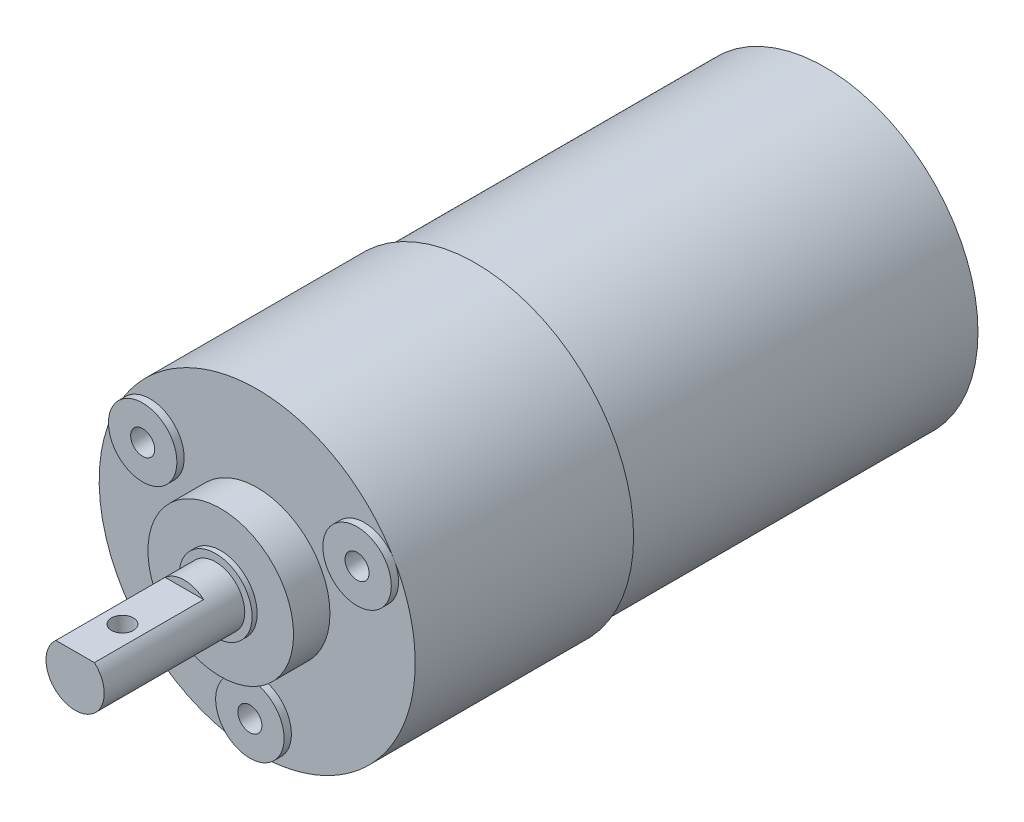
ISO-10303-21;
HEADER;
FILE_DESCRIPTION(('STEP AP214'),'2;1');
FILE_NAME('part.step','',(''),(''),'','','');
FILE_SCHEMA(('AUTOMOTIVE_DESIGN { 1 0 10303 214 1 1 1 1 }'));
ENDSEC;
DATA;
#1=APPLICATION_CONTEXT('core data for automotive mechanical design processes');
#2=APPLICATION_PROTOCOL_DEFINITION('international standard','automotive_design',2000,#1);
#3=PRODUCT_CONTEXT('',#1,'mechanical');
#4=PRODUCT('Part','Part','',(#3));
#5=PRODUCT_RELATED_PRODUCT_CATEGORY('part','',(#4));
#6=PRODUCT_DEFINITION_FORMATION('','',#4);
#7=PRODUCT_DEFINITION_CONTEXT('part definition',#1,'design');
#8=PRODUCT_DEFINITION('design','',#6,#7);
#9=PRODUCT_DEFINITION_SHAPE('','',#8);
#10=(LENGTH_UNIT() NAMED_UNIT(*) SI_UNIT(.MILLI.,.METRE.));
#11=(NAMED_UNIT(*) PLANE_ANGLE_UNIT() SI_UNIT($,.RADIAN.));
#12=(NAMED_UNIT(*) SI_UNIT($,.STERADIAN.) SOLID_ANGLE_UNIT());
#13=UNCERTAINTY_MEASURE_WITH_UNIT(LENGTH_MEASURE(1.E-05),#10,'distance_accuracy_value','');
#14=(GEOMETRIC_REPRESENTATION_CONTEXT(3) GLOBAL_UNCERTAINTY_ASSIGNED_CONTEXT((#13)) GLOBAL_UNIT_ASSIGNED_CONTEXT((#10,
#11,#12)) REPRESENTATION_CONTEXT('',''));
#15=CARTESIAN_POINT('',(0.,0.,0.));
#16=DIRECTION('',(0.,0.,1.));
#17=DIRECTION('',(1.,0.,0.));
#18=AXIS2_PLACEMENT_3D('',#15,#16,#17);
#19=CARTESIAN_POINT('',(0.,0.,83.));
#20=DIRECTION('',(0.,0.,1.));
#21=DIRECTION('',(1.,0.,0.));
#22=AXIS2_PLACEMENT_3D('',#19,#20,#21);
#23=PLANE('',#22);
#24=CARTESIAN_POINT('',(0.,0.,83.));
#25=DIRECTION('',(0.,0.,1.));
#26=DIRECTION('',(1.,0.,0.));
#27=AXIS2_PLACEMENT_3D('',#24,#25,#26);
#28=CIRCLE('',#27,10.);
#29=CARTESIAN_POINT('',(10.,0.,83.));
#30=VERTEX_POINT('',#29);
#31=EDGE_CURVE('E246',#30,#30,#28,.T.);
#32=ORIENTED_EDGE('',*,*,#31,.T.);
#33=EDGE_LOOP('',(#32));
#34=FACE_BOUND('',#33,.T.);
#35=CARTESIAN_POINT('',(0.,0.,83.));
#36=DIRECTION('',(0.,0.,1.));
#37=DIRECTION('',(1.,0.,0.));
#38=AXIS2_PLACEMENT_3D('',#35,#36,#37);
#39=CIRCLE('',#38,5.);
#40=CARTESIAN_POINT('',(5.,0.,83.));
#41=VERTEX_POINT('',#40);
#42=EDGE_CURVE('E275',#41,#41,#39,.T.);
#43=ORIENTED_EDGE('',*,*,#42,.F.);
#44=EDGE_LOOP('',(#43));
#45=FACE_BOUND('',#44,.T.);
#46=ADVANCED_FACE('F44',(#34,#45),#23,.T.);
#47=CARTESIAN_POINT('',(0.,0.,48.));
#48=DIRECTION('',(0.,0.,-1.));
#49=DIRECTION('',(-1.,0.,0.));
#50=AXIS2_PLACEMENT_3D('',#47,#48,#49);
#51=CYLINDRICAL_SURFACE('',#50,21.);
#52=CARTESIAN_POINT('',(0.,0.,48.));
#53=DIRECTION('',(0.,0.,1.));
#54=DIRECTION('',(1.,0.,0.));
#55=AXIS2_PLACEMENT_3D('',#52,#53,#54);
#56=CIRCLE('',#55,21.);
#57=CARTESIAN_POINT('',(21.,0.,48.));
#58=VERTEX_POINT('',#57);
#59=EDGE_CURVE('E11',#58,#58,#56,.T.);
#60=ORIENTED_EDGE('',*,*,#59,.F.);
#61=EDGE_LOOP('',(#60));
#62=FACE_BOUND('',#61,.T.);
#63=CARTESIAN_POINT('',(0.,0.,0.));
#64=DIRECTION('',(0.,0.,1.));
#65=DIRECTION('',(1.,0.,0.));
#66=AXIS2_PLACEMENT_3D('',#63,#64,#65);
#67=CIRCLE('',#66,21.);
#68=CARTESIAN_POINT('',(21.,0.,0.));
#69=VERTEX_POINT('',#68);
#70=EDGE_CURVE('E48',#69,#69,#67,.T.);
#71=ORIENTED_EDGE('',*,*,#70,.T.);
#72=EDGE_LOOP('',(#71));
#73=FACE_BOUND('',#72,.T.);
#74=ADVANCED_FACE('F46',(#62,#73),#51,.T.);
#75=CARTESIAN_POINT('',(0.,0.,0.));
#76=DIRECTION('',(0.,0.,1.));
#77=DIRECTION('',(1.,0.,0.));
#78=AXIS2_PLACEMENT_3D('',#75,#76,#77);
#79=PLANE('',#78);
#80=ORIENTED_EDGE('',*,*,#70,.F.);
#81=EDGE_LOOP('',(#80));
#82=FACE_BOUND('',#81,.T.);
#83=ADVANCED_FACE('F163',(#82),#79,.F.);
#84=CARTESIAN_POINT('',(0.,0.,78.));
#85=DIRECTION('',(0.,0.,-1.));
#86=DIRECTION('',(-1.,0.,0.));
#87=AXIS2_PLACEMENT_3D('',#84,#85,#86);
#88=CYLINDRICAL_SURFACE('',#87,21.7);
#89=CARTESIAN_POINT('',(0.,0.,78.));
#90=DIRECTION('',(0.,0.,1.));
#91=DIRECTION('',(1.,0.,0.));
#92=AXIS2_PLACEMENT_3D('',#89,#90,#91);
#93=CIRCLE('',#92,21.7);
#94=CARTESIAN_POINT('',(-18.7927512621223,10.8500000000001,78.));
#95=VERTEX_POINT('',#94);
#96=CARTESIAN_POINT('',(0.,-21.7,78.));
#97=VERTEX_POINT('',#96);
#98=EDGE_CURVE('E214',#95,#97,#93,.T.);
#99=ORIENTED_EDGE('',*,*,#98,.F.);
#100=CARTESIAN_POINT('',(18.7927512621224,10.8499999999998,78.));
#101=VERTEX_POINT('',#100);
#102=EDGE_CURVE('E218',#101,#95,#93,.T.);
#103=ORIENTED_EDGE('',*,*,#102,.F.);
#104=EDGE_CURVE('E216',#97,#101,#93,.T.);
#105=ORIENTED_EDGE('',*,*,#104,.F.);
#106=EDGE_LOOP('',(#99,#103,#105));
#107=FACE_BOUND('',#106,.T.);
#108=CARTESIAN_POINT('',(0.,0.,48.));
#109=DIRECTION('',(0.,0.,1.));
#110=DIRECTION('',(1.,0.,0.));
#111=AXIS2_PLACEMENT_3D('',#108,#109,#110);
#112=CIRCLE('',#111,21.7);
#113=CARTESIAN_POINT('',(21.7,0.,48.));
#114=VERTEX_POINT('',#113);
#115=EDGE_CURVE('E224',#114,#114,#112,.T.);
#116=ORIENTED_EDGE('',*,*,#115,.T.);
#117=EDGE_LOOP('',(#116));
#118=FACE_BOUND('',#117,.T.);
#119=ADVANCED_FACE('F200',(#107,#118),#88,.T.);
#120=CARTESIAN_POINT('',(0.,0.,78.));
#121=DIRECTION('',(0.,0.,1.));
#122=DIRECTION('',(1.,0.,0.));
#123=AXIS2_PLACEMENT_3D('',#120,#121,#122);
#124=PLANE('',#123);
#125=CARTESIAN_POINT('',(0.,0.,78.));
#126=DIRECTION('',(0.,0.,1.));
#127=DIRECTION('',(1.,0.,0.));
#128=AXIS2_PLACEMENT_3D('',#125,#126,#127);
#129=CIRCLE('',#128,10.);
#130=CARTESIAN_POINT('',(10.,0.,78.));
#131=VERTEX_POINT('',#130);
#132=EDGE_CURVE('E249',#131,#131,#129,.T.);
#133=ORIENTED_EDGE('',*,*,#132,.F.);
#134=EDGE_LOOP('',(#133));
#135=FACE_BOUND('',#134,.T.);
#136=ORIENTED_EDGE('',*,*,#98,.T.);
#137=CARTESIAN_POINT('',(0.,-17.,78.));
#138=DIRECTION('',(0.,0.,1.));
#139=DIRECTION('',(1.,0.,0.));
#140=AXIS2_PLACEMENT_3D('',#137,#138,#139);
#141=CIRCLE('',#140,4.7);
#142=EDGE_CURVE('E65',#97,#97,#141,.T.);
#143=ORIENTED_EDGE('',*,*,#142,.F.);
#144=ORIENTED_EDGE('',*,*,#104,.T.);
#145=CARTESIAN_POINT('',(14.7224318643355,8.49999999999986,78.));
#146=DIRECTION('',(0.,0.,1.));
#147=DIRECTION('',(1.,0.,0.));
#148=AXIS2_PLACEMENT_3D('',#145,#146,#147);
#149=CIRCLE('',#148,4.7);
#150=EDGE_CURVE('E239',#101,#101,#149,.T.);
#151=ORIENTED_EDGE('',*,*,#150,.F.);
#152=ORIENTED_EDGE('',*,*,#102,.T.);
#153=CARTESIAN_POINT('',(-14.7224318643354,8.50000000000007,78.));
#154=DIRECTION('',(0.,0.,1.));
#155=DIRECTION('',(1.,0.,0.));
#156=AXIS2_PLACEMENT_3D('',#153,#154,#155);
#157=CIRCLE('',#156,4.7);
#158=EDGE_CURVE('E232',#95,#95,#157,.T.);
#159=ORIENTED_EDGE('',*,*,#158,.F.);
#160=EDGE_LOOP('',(#136,#143,#144,#151,#152,#159));
#161=FACE_BOUND('',#160,.T.);
#162=ADVANCED_FACE('F197',(#135,#161),#124,.T.);
#163=CARTESIAN_POINT('',(0.,0.,48.));
#164=DIRECTION('',(0.,0.,1.));
#165=DIRECTION('',(1.,0.,0.));
#166=AXIS2_PLACEMENT_3D('',#163,#164,#165);
#167=PLANE('',#166);
#168=ORIENTED_EDGE('',*,*,#59,.T.);
#169=EDGE_LOOP('',(#168));
#170=FACE_BOUND('',#169,.T.);
#171=ORIENTED_EDGE('',*,*,#115,.F.);
#172=EDGE_LOOP('',(#171));
#173=FACE_BOUND('',#172,.T.);
#174=ADVANCED_FACE('F195',(#170,#173),#167,.F.);
#175=CARTESIAN_POINT('',(-14.7224318643354,8.50000000000007,79.));
#176=DIRECTION('',(0.,0.,-1.));
#177=DIRECTION('',(-1.,0.,0.));
#178=AXIS2_PLACEMENT_3D('',#175,#176,#177);
#179=CYLINDRICAL_SURFACE('',#178,4.7);
#180=CARTESIAN_POINT('',(-14.7224318643354,8.50000000000007,79.));
#181=DIRECTION('',(0.,0.,1.));
#182=DIRECTION('',(1.,0.,0.));
#183=AXIS2_PLACEMENT_3D('',#180,#181,#182);
#184=CIRCLE('',#183,4.7);
#185=CARTESIAN_POINT('',(-10.0224318643354,8.50000000000007,79.));
#186=VERTEX_POINT('',#185);
#187=EDGE_CURVE('E228',#186,#186,#184,.T.);
#188=ORIENTED_EDGE('',*,*,#187,.F.);
#189=EDGE_LOOP('',(#188));
#190=FACE_BOUND('',#189,.T.);
#191=ORIENTED_EDGE('',*,*,#158,.T.);
#192=EDGE_LOOP('',(#191));
#193=FACE_BOUND('',#192,.T.);
#194=ADVANCED_FACE('F191',(#190,#193),#179,.T.);
#195=CARTESIAN_POINT('',(0.,0.,79.));
#196=DIRECTION('',(0.,0.,1.));
#197=DIRECTION('',(1.,0.,0.));
#198=AXIS2_PLACEMENT_3D('',#195,#196,#197);
#199=PLANE('',#198);
#200=CARTESIAN_POINT('',(-14.7224318643354,8.50000000000007,79.));
#201=DIRECTION('',(0.,0.,1.));
#202=DIRECTION('',(1.,0.,0.));
#203=AXIS2_PLACEMENT_3D('',#200,#201,#202);
#204=CIRCLE('',#203,1.64999999999999);
#205=CARTESIAN_POINT('',(-13.0724318643354,8.50000000000007,79.));
#206=VERTEX_POINT('',#205);
#207=EDGE_CURVE('E112',#206,#206,#204,.T.);
#208=ORIENTED_EDGE('',*,*,#207,.F.);
#209=EDGE_LOOP('',(#208));
#210=FACE_BOUND('',#209,.T.);
#211=ORIENTED_EDGE('',*,*,#187,.T.);
#212=EDGE_LOOP('',(#211));
#213=FACE_BOUND('',#212,.T.);
#214=ADVANCED_FACE('F187',(#210,#213),#199,.T.);
#215=CARTESIAN_POINT('',(14.7224318643355,8.49999999999986,79.));
#216=DIRECTION('',(0.,0.,-1.));
#217=DIRECTION('',(-1.,0.,0.));
#218=AXIS2_PLACEMENT_3D('',#215,#216,#217);
#219=CYLINDRICAL_SURFACE('',#218,4.7);
#220=CARTESIAN_POINT('',(14.7224318643355,8.49999999999986,79.));
#221=DIRECTION('',(0.,0.,1.));
#222=DIRECTION('',(1.,0.,0.));
#223=AXIS2_PLACEMENT_3D('',#220,#221,#222);
#224=CIRCLE('',#223,4.7);
#225=CARTESIAN_POINT('',(19.4224318643355,8.49999999999986,79.));
#226=VERTEX_POINT('',#225);
#227=EDGE_CURVE('E237',#226,#226,#224,.T.);
#228=ORIENTED_EDGE('',*,*,#227,.F.);
#229=EDGE_LOOP('',(#228));
#230=FACE_BOUND('',#229,.T.);
#231=ORIENTED_EDGE('',*,*,#150,.T.);
#232=EDGE_LOOP('',(#231));
#233=FACE_BOUND('',#232,.T.);
#234=ADVANCED_FACE('F183',(#230,#233),#219,.T.);
#235=CARTESIAN_POINT('',(0.,0.,79.));
#236=DIRECTION('',(0.,0.,1.));
#237=DIRECTION('',(1.,0.,0.));
#238=AXIS2_PLACEMENT_3D('',#235,#236,#237);
#239=PLANE('',#238);
#240=CARTESIAN_POINT('',(14.7224318643355,8.49999999999986,79.));
#241=DIRECTION('',(0.,0.,1.));
#242=DIRECTION('',(1.,0.,0.));
#243=AXIS2_PLACEMENT_3D('',#240,#241,#242);
#244=CIRCLE('',#243,1.64999999999999);
#245=CARTESIAN_POINT('',(16.3724318643355,8.49999999999986,79.));
#246=VERTEX_POINT('',#245);
#247=EDGE_CURVE('E99',#246,#246,#244,.T.);
#248=ORIENTED_EDGE('',*,*,#247,.F.);
#249=EDGE_LOOP('',(#248));
#250=FACE_BOUND('',#249,.T.);
#251=ORIENTED_EDGE('',*,*,#227,.T.);
#252=EDGE_LOOP('',(#251));
#253=FACE_BOUND('',#252,.T.);
#254=ADVANCED_FACE('F179',(#250,#253),#239,.T.);
#255=CARTESIAN_POINT('',(0.,-17.,79.));
#256=DIRECTION('',(0.,0.,-1.));
#257=DIRECTION('',(-1.,0.,0.));
#258=AXIS2_PLACEMENT_3D('',#255,#256,#257);
#259=CYLINDRICAL_SURFACE('',#258,4.7);
#260=CARTESIAN_POINT('',(0.,-17.,79.));
#261=DIRECTION('',(0.,0.,1.));
#262=DIRECTION('',(1.,0.,0.));
#263=AXIS2_PLACEMENT_3D('',#260,#261,#262);
#264=CIRCLE('',#263,4.7);
#265=CARTESIAN_POINT('',(4.7,-17.,79.));
#266=VERTEX_POINT('',#265);
#267=EDGE_CURVE('E242',#266,#266,#264,.T.);
#268=ORIENTED_EDGE('',*,*,#267,.F.);
#269=EDGE_LOOP('',(#268));
#270=FACE_BOUND('',#269,.T.);
#271=ORIENTED_EDGE('',*,*,#142,.T.);
#272=EDGE_LOOP('',(#271));
#273=FACE_BOUND('',#272,.T.);
#274=ADVANCED_FACE('F175',(#270,#273),#259,.T.);
#275=CARTESIAN_POINT('',(0.,0.,79.));
#276=DIRECTION('',(0.,0.,1.));
#277=DIRECTION('',(1.,0.,0.));
#278=AXIS2_PLACEMENT_3D('',#275,#276,#277);
#279=PLANE('',#278);
#280=CARTESIAN_POINT('',(0.,-17.,79.));
#281=DIRECTION('',(0.,0.,1.));
#282=DIRECTION('',(1.,0.,0.));
#283=AXIS2_PLACEMENT_3D('',#280,#281,#282);
#284=CIRCLE('',#283,1.64999999999999);
#285=CARTESIAN_POINT('',(1.64999999999999,-17.,79.));
#286=VERTEX_POINT('',#285);
#287=EDGE_CURVE('E100',#286,#286,#284,.T.);
#288=ORIENTED_EDGE('',*,*,#287,.F.);
#289=EDGE_LOOP('',(#288));
#290=FACE_BOUND('',#289,.T.);
#291=ORIENTED_EDGE('',*,*,#267,.T.);
#292=EDGE_LOOP('',(#291));
#293=FACE_BOUND('',#292,.T.);
#294=ADVANCED_FACE('F171',(#290,#293),#279,.T.);
#295=CARTESIAN_POINT('',(0.,0.,83.));
#296=DIRECTION('',(0.,0.,-1.));
#297=DIRECTION('',(-1.,0.,0.));
#298=AXIS2_PLACEMENT_3D('',#295,#296,#297);
#299=CYLINDRICAL_SURFACE('',#298,10.);
#300=ORIENTED_EDGE('',*,*,#31,.F.);
#301=EDGE_LOOP('',(#300));
#302=FACE_BOUND('',#301,.T.);
#303=ORIENTED_EDGE('',*,*,#132,.T.);
#304=EDGE_LOOP('',(#303));
#305=FACE_BOUND('',#304,.T.);
#306=ADVANCED_FACE('F168',(#302,#305),#299,.T.);
#307=CARTESIAN_POINT('',(-14.7224318643354,8.50000000000007,68.9));
#308=DIRECTION('',(0.,0.,1.));
#309=DIRECTION('',(1.,0.,0.));
#310=AXIS2_PLACEMENT_3D('',#307,#308,#309);
#311=CONICAL_SURFACE('',#310,1.64999999999999,1.02974425867665);
#312=CARTESIAN_POINT('',(-14.7224318643354,8.50000000000007,67.9085799786045));
#313=VERTEX_POINT('',#312);
#314=VERTEX_LOOP('',#313);
#315=FACE_BOUND('',#314,.T.);
#316=CARTESIAN_POINT('',(-14.7224318643354,8.50000000000007,68.9));
#317=DIRECTION('',(0.,0.,1.));
#318=DIRECTION('',(1.,0.,0.));
#319=AXIS2_PLACEMENT_3D('',#316,#317,#318);
#320=CIRCLE('',#319,1.64999999999999);
#321=CARTESIAN_POINT('',(-13.0724318643354,8.50000000000007,68.9));
#322=VERTEX_POINT('',#321);
#323=EDGE_CURVE('E115',#322,#322,#320,.T.);
#324=ORIENTED_EDGE('',*,*,#323,.T.);
#325=EDGE_LOOP('',(#324));
#326=FACE_BOUND('',#325,.T.);
#327=ADVANCED_FACE('F143',(#315,#326),#311,.F.);
#328=CARTESIAN_POINT('',(-14.7224318643354,8.50000000000007,79.));
#329=DIRECTION('',(0.,0.,1.));
#330=DIRECTION('',(1.,0.,0.));
#331=AXIS2_PLACEMENT_3D('',#328,#329,#330);
#332=CYLINDRICAL_SURFACE('',#331,1.64999999999999);
#333=ORIENTED_EDGE('',*,*,#323,.F.);
#334=EDGE_LOOP('',(#333));
#335=FACE_BOUND('',#334,.T.);
#336=ORIENTED_EDGE('',*,*,#207,.T.);
#337=EDGE_LOOP('',(#336));
#338=FACE_BOUND('',#337,.T.);
#339=ADVANCED_FACE('F300',(#335,#338),#332,.F.);
#340=CARTESIAN_POINT('',(14.7224318643355,8.49999999999986,68.9));
#341=DIRECTION('',(0.,0.,1.));
#342=DIRECTION('',(1.,0.,0.));
#343=AXIS2_PLACEMENT_3D('',#340,#341,#342);
#344=CONICAL_SURFACE('',#343,1.64999999999999,1.02974425867665);
#345=CARTESIAN_POINT('',(14.7224318643355,8.49999999999986,67.9085799786045));
#346=VERTEX_POINT('',#345);
#347=VERTEX_LOOP('',#346);
#348=FACE_BOUND('',#347,.T.);
#349=CARTESIAN_POINT('',(14.7224318643355,8.49999999999986,68.9));
#350=DIRECTION('',(0.,0.,1.));
#351=DIRECTION('',(1.,0.,0.));
#352=AXIS2_PLACEMENT_3D('',#349,#350,#351);
#353=CIRCLE('',#352,1.64999999999999);
#354=CARTESIAN_POINT('',(16.3724318643355,8.49999999999986,68.9));
#355=VERTEX_POINT('',#354);
#356=EDGE_CURVE('E103',#355,#355,#353,.T.);
#357=ORIENTED_EDGE('',*,*,#356,.T.);
#358=EDGE_LOOP('',(#357));
#359=FACE_BOUND('',#358,.T.);
#360=ADVANCED_FACE('F297',(#348,#359),#344,.F.);
#361=CARTESIAN_POINT('',(14.7224318643355,8.49999999999986,79.));
#362=DIRECTION('',(0.,0.,1.));
#363=DIRECTION('',(1.,0.,0.));
#364=AXIS2_PLACEMENT_3D('',#361,#362,#363);
#365=CYLINDRICAL_SURFACE('',#364,1.64999999999999);
#366=ORIENTED_EDGE('',*,*,#356,.F.);
#367=EDGE_LOOP('',(#366));
#368=FACE_BOUND('',#367,.T.);
#369=ORIENTED_EDGE('',*,*,#247,.T.);
#370=EDGE_LOOP('',(#369));
#371=FACE_BOUND('',#370,.T.);
#372=ADVANCED_FACE('F93',(#368,#371),#365,.F.);
#373=CARTESIAN_POINT('',(0.,-17.,68.9));
#374=DIRECTION('',(0.,0.,1.));
#375=DIRECTION('',(1.,0.,0.));
#376=AXIS2_PLACEMENT_3D('',#373,#374,#375);
#377=CONICAL_SURFACE('',#376,1.64999999999999,1.02974425867665);
#378=CARTESIAN_POINT('',(0.,-17.,67.9085799786045));
#379=VERTEX_POINT('',#378);
#380=VERTEX_LOOP('',#379);
#381=FACE_BOUND('',#380,.T.);
#382=CARTESIAN_POINT('',(0.,-17.,68.9));
#383=DIRECTION('',(0.,0.,1.));
#384=DIRECTION('',(1.,0.,0.));
#385=AXIS2_PLACEMENT_3D('',#382,#383,#384);
#386=CIRCLE('',#385,1.64999999999999);
#387=CARTESIAN_POINT('',(1.64999999999999,-17.,68.9));
#388=VERTEX_POINT('',#387);
#389=EDGE_CURVE('E97',#388,#388,#386,.T.);
#390=ORIENTED_EDGE('',*,*,#389,.T.);
#391=EDGE_LOOP('',(#390));
#392=FACE_BOUND('',#391,.T.);
#393=ADVANCED_FACE('F89',(#381,#392),#377,.F.);
#394=CARTESIAN_POINT('',(0.,-17.,79.));
#395=DIRECTION('',(0.,0.,1.));
#396=DIRECTION('',(1.,0.,0.));
#397=AXIS2_PLACEMENT_3D('',#394,#395,#396);
#398=CYLINDRICAL_SURFACE('',#397,1.64999999999999);
#399=ORIENTED_EDGE('',*,*,#389,.F.);
#400=EDGE_LOOP('',(#399));
#401=FACE_BOUND('',#400,.T.);
#402=ORIENTED_EDGE('',*,*,#287,.T.);
#403=EDGE_LOOP('',(#402));
#404=FACE_BOUND('',#403,.T.);
#405=ADVANCED_FACE('F92',(#401,#404),#398,.F.);
#406=CARTESIAN_POINT('',(0.,0.,83.7));
#407=DIRECTION('',(0.,0.,1.));
#408=DIRECTION('',(1.,0.,0.));
#409=AXIS2_PLACEMENT_3D('',#406,#407,#408);
#410=PLANE('',#409);
#411=CARTESIAN_POINT('',(0.,0.,83.7));
#412=DIRECTION('',(0.,0.,1.));
#413=DIRECTION('',(1.,0.,0.));
#414=AXIS2_PLACEMENT_3D('',#411,#412,#413);
#415=CIRCLE('',#414,5.);
#416=CARTESIAN_POINT('',(5.,0.,83.7));
#417=VERTEX_POINT('',#416);
#418=EDGE_CURVE('E106',#417,#417,#415,.T.);
#419=ORIENTED_EDGE('',*,*,#418,.T.);
#420=EDGE_LOOP('',(#419));
#421=FACE_BOUND('',#420,.T.);
#422=CARTESIAN_POINT('',(0.,0.,83.7));
#423=DIRECTION('',(0.,0.,1.));
#424=DIRECTION('',(1.,0.,0.));
#425=AXIS2_PLACEMENT_3D('',#422,#423,#424);
#426=CIRCLE('',#425,4.);
#427=CARTESIAN_POINT('',(4.,0.,83.7));
#428=VERTEX_POINT('',#427);
#429=EDGE_CURVE('E271',#428,#428,#426,.T.);
#430=ORIENTED_EDGE('',*,*,#429,.F.);
#431=EDGE_LOOP('',(#430));
#432=FACE_BOUND('',#431,.T.);
#433=ADVANCED_FACE('F282',(#421,#432),#410,.T.);
#434=CARTESIAN_POINT('',(0.,0.,83.7));
#435=DIRECTION('',(0.,0.,-1.));
#436=DIRECTION('',(-1.,0.,0.));
#437=AXIS2_PLACEMENT_3D('',#434,#435,#436);
#438=CYLINDRICAL_SURFACE('',#437,5.);
#439=ORIENTED_EDGE('',*,*,#418,.F.);
#440=EDGE_LOOP('',(#439));
#441=FACE_BOUND('',#440,.T.);
#442=ORIENTED_EDGE('',*,*,#42,.T.);
#443=EDGE_LOOP('',(#442));
#444=FACE_BOUND('',#443,.T.);
#445=ADVANCED_FACE('F151',(#441,#444),#438,.T.);
#446=CARTESIAN_POINT('',(0.,0.,88.));
#447=DIRECTION('',(0.,0.,1.));
#448=DIRECTION('',(1.,0.,0.));
#449=AXIS2_PLACEMENT_3D('',#446,#447,#448);
#450=PLANE('',#449);
#451=DIRECTION('',(1.,0.,0.));
#452=VECTOR('',#451,1.);
#453=CARTESIAN_POINT('',(-2.64575131106459,3.,88.));
#454=LINE('',#453,#452);
#455=CARTESIAN_POINT('',(-2.64575131106459,3.,88.));
#456=VERTEX_POINT('',#455);
#457=CARTESIAN_POINT('',(2.64575131106459,3.,88.));
#458=VERTEX_POINT('',#457);
#459=EDGE_CURVE('E130',#456,#458,#454,.T.);
#460=ORIENTED_EDGE('',*,*,#459,.T.);
#461=CARTESIAN_POINT('',(0.,0.,88.));
#462=DIRECTION('',(0.,0.,1.));
#463=DIRECTION('',(1.,0.,0.));
#464=AXIS2_PLACEMENT_3D('',#461,#462,#463);
#465=CIRCLE('',#464,4.);
#466=EDGE_CURVE('E129',#458,#456,#465,.T.);
#467=ORIENTED_EDGE('',*,*,#466,.T.);
#468=EDGE_LOOP('',(#460,#467));
#469=FACE_BOUND('',#468,.T.);
#470=ADVANCED_FACE('F149',(#469),#450,.T.);
#471=CARTESIAN_POINT('',(0.,0.,103.));
#472=DIRECTION('',(0.,0.,1.));
#473=DIRECTION('',(1.,0.,0.));
#474=AXIS2_PLACEMENT_3D('',#471,#472,#473);
#475=PLANE('',#474);
#476=CARTESIAN_POINT('',(0.,0.,103.));
#477=DIRECTION('',(0.,0.,1.));
#478=DIRECTION('',(1.,0.,0.));
#479=AXIS2_PLACEMENT_3D('',#476,#477,#478);
#480=CIRCLE('',#479,4.);
#481=CARTESIAN_POINT('',(-2.64575131106459,3.,103.));
#482=VERTEX_POINT('',#481);
#483=CARTESIAN_POINT('',(2.64575131106459,3.,103.));
#484=VERTEX_POINT('',#483);
#485=EDGE_CURVE('E252',#482,#484,#480,.T.);
#486=ORIENTED_EDGE('',*,*,#485,.T.);
#487=DIRECTION('',(1.,0.,0.));
#488=VECTOR('',#487,1.);
#489=CARTESIAN_POINT('',(-2.64575131106459,3.,103.));
#490=LINE('',#489,#488);
#491=EDGE_CURVE('E255',#482,#484,#490,.T.);
#492=ORIENTED_EDGE('',*,*,#491,.F.);
#493=EDGE_LOOP('',(#486,#492));
#494=FACE_BOUND('',#493,.T.);
#495=ADVANCED_FACE('F147',(#494),#475,.T.);
#496=CARTESIAN_POINT('',(-2.64575131106459,3.,321.625573393399));
#497=DIRECTION('',(0.,1.,0.));
#498=DIRECTION('',(0.,0.,1.));
#499=AXIS2_PLACEMENT_3D('',#496,#497,#498);
#500=PLANE('',#499);
#501=CARTESIAN_POINT('',(0.,3.,96.5));
#502=DIRECTION('',(0.,1.,0.));
#503=DIRECTION('',(0.,0.,1.));
#504=AXIS2_PLACEMENT_3D('',#501,#502,#503);
#505=CIRCLE('',#504,1.5);
#506=CARTESIAN_POINT('',(0.,3.,98.));
#507=VERTEX_POINT('',#506);
#508=EDGE_CURVE('E118',#507,#507,#505,.T.);
#509=ORIENTED_EDGE('',*,*,#508,.F.);
#510=EDGE_LOOP('',(#509));
#511=FACE_BOUND('',#510,.T.);
#512=DIRECTION('',(0.,0.,-1.));
#513=VECTOR('',#512,1.);
#514=CARTESIAN_POINT('',(-2.64575131106459,3.,321.625573393399));
#515=LINE('',#514,#513);
#516=EDGE_CURVE('E59',#482,#456,#515,.T.);
#517=ORIENTED_EDGE('',*,*,#516,.F.);
#518=ORIENTED_EDGE('',*,*,#491,.T.);
#519=DIRECTION('',(0.,0.,-1.));
#520=VECTOR('',#519,1.);
#521=CARTESIAN_POINT('',(2.64575131106459,3.,321.625573393399));
#522=LINE('',#521,#520);
#523=EDGE_CURVE('E258',#484,#458,#522,.T.);
#524=ORIENTED_EDGE('',*,*,#523,.T.);
#525=ORIENTED_EDGE('',*,*,#459,.F.);
#526=EDGE_LOOP('',(#517,#518,#524,#525));
#527=FACE_BOUND('',#526,.T.);
#528=ADVANCED_FACE('F141',(#511,#527),#500,.T.);
#529=CARTESIAN_POINT('',(0.,-12.,96.5));
#530=DIRECTION('',(0.,1.,0.));
#531=DIRECTION('',(0.,0.,1.));
#532=AXIS2_PLACEMENT_3D('',#529,#530,#531);
#533=CYLINDRICAL_SURFACE('',#532,1.5);
#534=ORIENTED_EDGE('',*,*,#508,.T.);
#535=EDGE_LOOP('',(#534));
#536=FACE_BOUND('',#535,.T.);
#537=CARTESIAN_POINT('',(0.,-4.,98.));
#538=CARTESIAN_POINT('',(0.0812350589378524,-4.00000217456151,98.0000029023031));
#539=CARTESIAN_POINT('',(0.162450241781791,-3.99750379283184,97.9933802397516));
#540=CARTESIAN_POINT('',(0.32245345235236,-3.98778696006928,97.9671718047301));
#541=CARTESIAN_POINT('',(0.401241827987617,-3.98056918893993,97.9475878995294));
#542=CARTESIAN_POINT('',(0.554060784990879,-3.96218832391545,97.8962469982282));
#543=CARTESIAN_POINT('',(0.628100224162276,-3.9510328434944,97.8645134831782));
#544=CARTESIAN_POINT('',(0.769799310160252,-3.92588767765353,97.7898935869842));
#545=CARTESIAN_POINT('',(0.83745723917788,-3.91189723227548,97.7470042144559));
#546=CARTESIAN_POINT('',(0.967346417045831,-3.88186246971217,97.6493874689291));
#547=CARTESIAN_POINT('',(1.0292707301512,-3.86576002583566,97.5942697377406));
#548=CARTESIAN_POINT('',(1.14324421474364,-3.83360220871326,97.4745895653411));
#549=CARTESIAN_POINT('',(1.19529036359203,-3.81754685135032,97.4100242439121));
#550=CARTESIAN_POINT('',(1.28998202215985,-3.78662470617731,97.2702825324768));
#551=CARTESIAN_POINT('',(1.3321939319576,-3.77182648820818,97.1947956334542));
#552=CARTESIAN_POINT('',(1.40318646334084,-3.74599860237433,97.0371516458315));
#553=CARTESIAN_POINT('',(1.43197244961239,-3.73496742975881,96.9549972368449));
#554=CARTESIAN_POINT('',(1.47408431017549,-3.71854412824136,96.7898832597418));
#555=CARTESIAN_POINT('',(1.48799593218558,-3.71293924350838,96.7070949615646));
#556=CARTESIAN_POINT('',(1.50179556531648,-3.70738061461215,96.5401838420062));
#557=CARTESIAN_POINT('',(1.50168936802631,-3.70742453659305,96.4560615861255));
#558=CARTESIAN_POINT('',(1.48790429610018,-3.71297511632055,96.294230474787));
#559=CARTESIAN_POINT('',(1.47503808509003,-3.71815468871122,96.2164390939558));
#560=CARTESIAN_POINT('',(1.4374416786833,-3.7328493805953,96.0642128495947));
#561=CARTESIAN_POINT('',(1.41270969663258,-3.74236515298863,95.9897784933861));
#562=CARTESIAN_POINT('',(1.35163748571903,-3.76485702190253,95.8447229322718));
#563=CARTESIAN_POINT('',(1.315086487371,-3.77789517988166,95.7742005138787));
#564=CARTESIAN_POINT('',(1.23156073762697,-3.8059421013932,95.640054262409));
#565=CARTESIAN_POINT('',(1.18458238728896,-3.82095154457158,95.5764328224803));
#566=CARTESIAN_POINT('',(1.07781780766549,-3.85248038859113,95.4533963363491));
#567=CARTESIAN_POINT('',(1.01738298716955,-3.86903347455671,95.3945513592519));
#568=CARTESIAN_POINT('',(0.887312590819016,-3.90091728164086,95.2876620337942));
#569=CARTESIAN_POINT('',(0.81767560349736,-3.91624781465952,95.2396193453943));
#570=CARTESIAN_POINT('',(0.669723436992419,-3.9442639480908,95.1550696029375));
#571=CARTESIAN_POINT('',(0.591290713844721,-3.95690498259616,95.1187524187789));
#572=CARTESIAN_POINT('',(0.428836850524587,-3.97778718326962,95.06001739573));
#573=CARTESIAN_POINT('',(0.344818210845771,-3.98603030341493,95.0375933834389));
#574=CARTESIAN_POINT('',(0.178375243148668,-3.99684443228065,95.0083772124581));
#575=CARTESIAN_POINT('',(0.0961036195622116,-3.99969369025686,95.0008173936175));
#576=CARTESIAN_POINT('',(-0.0685724752550238,-4.00025893700126,94.9993089361001));
#577=CARTESIAN_POINT('',(-0.150976912983374,-3.99797606386863,95.0053572796832));
#578=CARTESIAN_POINT('',(-0.310262048561861,-3.98871709772643,95.0303100423087));
#579=CARTESIAN_POINT('',(-0.387233328007338,-3.98192470962305,95.0487115437371));
#580=CARTESIAN_POINT('',(-0.536941754957221,-3.96451477091717,95.0971860725473));
#581=CARTESIAN_POINT('',(-0.609678350347533,-3.9538967228203,95.127260617948));
#582=CARTESIAN_POINT('',(-0.751247765110154,-3.92949624407682,95.1991864124395));
#583=CARTESIAN_POINT('',(-0.819903083557795,-3.91563000209348,95.2413577292234));
#584=CARTESIAN_POINT('',(-0.949392711726625,-3.88626671564664,95.3359181031716));
#585=CARTESIAN_POINT('',(-1.01022412027045,-3.87076907009516,95.3883109325452));
#586=CARTESIAN_POINT('',(-1.12603079874454,-3.8387332949099,95.5054041221243));
#587=CARTESIAN_POINT('',(-1.18046154123568,-3.82218696503729,95.5706421827727));
#588=CARTESIAN_POINT('',(-1.27771050031903,-3.79078815746854,95.7096513847077));
#589=CARTESIAN_POINT('',(-1.32052767414519,-3.77593583194399,95.7834232913885));
#590=CARTESIAN_POINT('',(-1.39337773518998,-3.74966829822463,95.9380159867723));
#591=CARTESIAN_POINT('',(-1.42335685446918,-3.73826760328493,96.0188647459104));
#592=CARTESIAN_POINT('',(-1.46907883466889,-3.72054032891005,96.1850097636878));
#593=CARTESIAN_POINT('',(-1.48483050305535,-3.71421061057491,96.2703032361981));
#594=CARTESIAN_POINT('',(-1.50086347097839,-3.70775894792573,96.4370161595411));
#595=CARTESIAN_POINT('',(-1.50207331495837,-3.70726444523341,96.5183326317169));
#596=CARTESIAN_POINT('',(-1.49136715641593,-3.71158412745292,96.6799453162762));
#597=CARTESIAN_POINT('',(-1.47945239850124,-3.71639780898899,96.7602416246716));
#598=CARTESIAN_POINT('',(-1.44355815630242,-3.73048141585432,96.9150472267166));
#599=CARTESIAN_POINT('',(-1.41995798316524,-3.73961085376663,96.9896583462453));
#600=CARTESIAN_POINT('',(-1.3616969677992,-3.76121548297845,97.1339055084944));
#601=CARTESIAN_POINT('',(-1.32703332944945,-3.77369151995215,97.2035402880701));
#602=CARTESIAN_POINT('',(-1.24552075938154,-3.80139723903964,97.3398267896976));
#603=CARTESIAN_POINT('',(-1.19812832803011,-3.81673698440964,97.4061307967999));
#604=CARTESIAN_POINT('',(-1.09334485729907,-3.84806246757177,97.5301415609712));
#605=CARTESIAN_POINT('',(-1.03595064012809,-3.86404840943145,97.5878455747867));
#606=CARTESIAN_POINT('',(-0.90908039678463,-3.89590424609881,97.6962019558218));
#607=CARTESIAN_POINT('',(-0.839118644212999,-3.91172104900645,97.7463037534347));
#608=CARTESIAN_POINT('',(-0.691213223200825,-3.9405451445703,97.8340226552766));
#609=CARTESIAN_POINT('',(-0.613268934090625,-3.95355221851559,97.8716387877364));
#610=CARTESIAN_POINT('',(-0.447999082002313,-3.9757429260668,97.9343768290483));
#611=CARTESIAN_POINT('',(-0.360413422234208,-3.98473657158356,97.9588870646019));
#612=CARTESIAN_POINT('',(-0.181875733606381,-3.99686242179587,97.9916929599207));
#613=CARTESIAN_POINT('',(-0.0909254163648582,-3.99999756603967,97.9999967514873));
#614=CARTESIAN_POINT('',(0.,-4.,98.));
#615=B_SPLINE_CURVE_WITH_KNOTS('',3,(#537,#538,#539,#540,#541,#542,#543,#544,#545,#546,#547,
#548,#549,#550,#551,#552,#553,#554,#555,#556,#557,#558,#559,#560,#561,#562,#563,#564,#565,#566,
#567,#568,#569,#570,#571,#572,#573,#574,#575,#576,#577,#578,#579,#580,#581,#582,#583,#584,#585,
#586,#587,#588,#589,#590,#591,#592,#593,#594,#595,#596,#597,#598,#599,#600,#601,#602,#603,#604,
#605,#606,#607,#608,#609,#610,#611,#612,#613,#614),.UNSPECIFIED.,.T.,.F.,(4,2,2,2,2,2,2,2,2,2,2,
2,2,2,2,2,2,2,2,2,2,2,2,2,2,2,2,2,2,2,2,2,2,2,2,2,2,2,4),(0.,0.243369801560559,
0.486704549530459,0.729571369213572,0.972503379609487,1.22473618582717,1.47704604925623,
1.73896674501658,2.00078269352134,2.25185874416901,2.50283106079708,2.73878345119974,
2.97477138060591,3.21522408387019,3.45575990744259,3.71246153335814,3.96920257905066,
4.22991375286075,4.49050899698846,4.73725019635926,4.98393668390521,5.2211443792384,
5.45838293254454,5.70259221859599,5.94689180019868,6.20536519455659,6.46386178920142,
6.72343066727205,6.98283874956506,7.22558763480251,7.46831350211259,7.70363142426533,
7.93900886656507,8.1867247188427,8.43451941997061,8.69572329654039,8.95694749805102,
9.22948515032043,9.50188601796128),.UNSPECIFIED.);
#616=CARTESIAN_POINT('',(0.,-4.,98.));
#617=VERTEX_POINT('',#616);
#618=EDGE_CURVE('E121',#617,#617,#615,.T.);
#619=ORIENTED_EDGE('',*,*,#618,.F.);
#620=EDGE_LOOP('',(#619));
#621=FACE_BOUND('',#620,.T.);
#622=ADVANCED_FACE('F136',(#536,#621),#533,.F.);
#623=CARTESIAN_POINT('',(0.,0.,103.));
#624=DIRECTION('',(0.,0.,-1.));
#625=DIRECTION('',(-1.,0.,0.));
#626=AXIS2_PLACEMENT_3D('',#623,#624,#625);
#627=CYLINDRICAL_SURFACE('',#626,4.);
#628=ORIENTED_EDGE('',*,*,#429,.T.);
#629=EDGE_LOOP('',(#628));
#630=FACE_BOUND('',#629,.T.);
#631=ORIENTED_EDGE('',*,*,#618,.T.);
#632=EDGE_LOOP('',(#631));
#633=FACE_BOUND('',#632,.T.);
#634=ORIENTED_EDGE('',*,*,#523,.F.);
#635=ORIENTED_EDGE('',*,*,#485,.F.);
#636=ORIENTED_EDGE('',*,*,#516,.T.);
#637=ORIENTED_EDGE('',*,*,#466,.F.);
#638=EDGE_LOOP('',(#634,#635,#636,#637));
#639=FACE_BOUND('',#638,.T.);
#640=ADVANCED_FACE('F132',(#630,#633,#639),#627,.T.);
#641=CLOSED_SHELL('',(#46,#74,#83,#119,#162,#174,#194,#214,#234,#254,#274,#294,#306,#327,#339,
#360,#372,#393,#405,#433,#445,#470,#495,#528,#622,#640));
#642=MANIFOLD_SOLID_BREP('B2',#641);
#643=ADVANCED_BREP_SHAPE_REPRESENTATION('',(#18,#642),#14);
#644=SHAPE_DEFINITION_REPRESENTATION(#9,#643);
ENDSEC;
END-ISO-10303-21;
